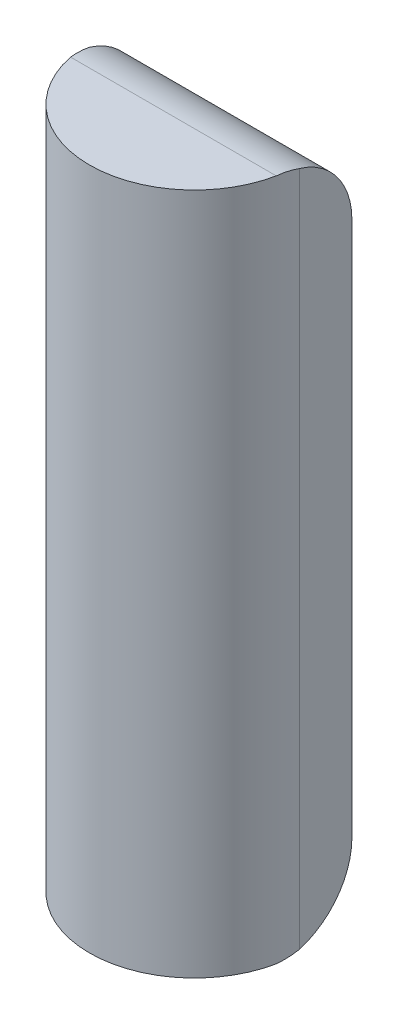
ISO-10303-21;
HEADER;
FILE_DESCRIPTION(('STEP AP214'),'2;1');
FILE_NAME('part.step','',(''),(''),'','','');
FILE_SCHEMA(('AUTOMOTIVE_DESIGN { 1 0 10303 214 1 1 1 1 }'));
ENDSEC;
DATA;
#1=APPLICATION_CONTEXT('core data for automotive mechanical design processes');
#2=APPLICATION_PROTOCOL_DEFINITION('international standard','automotive_design',2000,#1);
#3=PRODUCT_CONTEXT('',#1,'mechanical');
#4=PRODUCT('Part','Part','',(#3));
#5=PRODUCT_RELATED_PRODUCT_CATEGORY('part','',(#4));
#6=PRODUCT_DEFINITION_FORMATION('','',#4);
#7=PRODUCT_DEFINITION_CONTEXT('part definition',#1,'design');
#8=PRODUCT_DEFINITION('design','',#6,#7);
#9=PRODUCT_DEFINITION_SHAPE('','',#8);
#10=(LENGTH_UNIT() NAMED_UNIT(*) SI_UNIT(.MILLI.,.METRE.));
#11=(NAMED_UNIT(*) PLANE_ANGLE_UNIT() SI_UNIT($,.RADIAN.));
#12=(NAMED_UNIT(*) SI_UNIT($,.STERADIAN.) SOLID_ANGLE_UNIT());
#13=UNCERTAINTY_MEASURE_WITH_UNIT(LENGTH_MEASURE(1.E-05),#10,'distance_accuracy_value','');
#14=(GEOMETRIC_REPRESENTATION_CONTEXT(3) GLOBAL_UNCERTAINTY_ASSIGNED_CONTEXT((#13)) GLOBAL_UNIT_ASSIGNED_CONTEXT((#10,
#11,#12)) REPRESENTATION_CONTEXT('',''));
#15=CARTESIAN_POINT('',(0.,0.,0.));
#16=DIRECTION('',(0.,0.,1.));
#17=DIRECTION('',(1.,0.,0.));
#18=AXIS2_PLACEMENT_3D('',#15,#16,#17);
#19=CARTESIAN_POINT('',(-0.6,0.,-0.35));
#20=DIRECTION('',(0.,1.,0.));
#21=DIRECTION('',(0.,0.,1.));
#22=AXIS2_PLACEMENT_3D('',#19,#20,#21);
#23=CYLINDRICAL_SURFACE('',#22,0.1);
#24=CARTESIAN_POINT('',(-0.6,0.,-0.35));
#25=DIRECTION('',(0.,1.,0.));
#26=DIRECTION('',(0.,0.,1.));
#27=AXIS2_PLACEMENT_3D('',#24,#25,#26);
#28=CIRCLE('',#27,0.1);
#29=CARTESIAN_POINT('',(-0.697979589711327,0.,-0.33));
#30=VERTEX_POINT('',#29);
#31=CARTESIAN_POINT('',(-0.502020410288673,0.,-0.33));
#32=VERTEX_POINT('',#31);
#33=EDGE_CURVE('E11',#30,#32,#28,.T.);
#34=ORIENTED_EDGE('',*,*,#33,.T.);
#35=CARTESIAN_POINT('',(-0.5,0.00291796067500546,-0.349999999999997));
#36=CARTESIAN_POINT('',(-0.500084183762029,0.00267649394960232,-0.349190121189793));
#37=CARTESIAN_POINT('',(-0.500168367524058,0.00244970743001094,-0.348375866058584));
#38=CARTESIAN_POINT('',(-0.500336735048117,0.00202576163123395,-0.34673967912913));
#39=CARTESIAN_POINT('',(-0.500420918810146,0.00182860235204834,-0.345917747330885));
#40=CARTESIAN_POINT('',(-0.500589286334204,0.00146417786286509,-0.344267283042332));
#41=CARTESIAN_POINT('',(-0.500673470096233,0.00129691265286746,-0.343438750552023));
#42=CARTESIAN_POINT('',(-0.500841837620292,0.000992493455461815,-0.341776172212152));
#43=CARTESIAN_POINT('',(-0.500926021382321,0.000855339468053803,-0.340942126362589));
#44=CARTESIAN_POINT('',(-0.501094388906379,0.000611323369011913,-0.339269615138349));
#45=CARTESIAN_POINT('',(-0.501178572668408,0.000504461257378036,-0.338431149763672));
#46=CARTESIAN_POINT('',(-0.501346940192467,0.000321168311295584,-0.336750899341898));
#47=CARTESIAN_POINT('',(-0.501431123954496,0.000244737476847011,-0.3359091142948));
#48=CARTESIAN_POINT('',(-0.501599491478554,0.000122409650322978,-0.334223328579187));
#49=CARTESIAN_POINT('',(-0.501683675240583,7.65126582475191E-05,-0.333379327910672));
#50=CARTESIAN_POINT('',(-0.501852042764642,1.53042319068217E-05,-0.331690218311812));
#51=CARTESIAN_POINT('',(-0.501936226526671,-7.2023584184188E-09,-0.330845109381467));
#52=CARTESIAN_POINT('',(-0.5020204102887,0.,-0.33));
#53=B_SPLINE_CURVE_WITH_KNOTS('',3,(#35,#36,#37,#38,#39,#40,#41,#42,#43,#44,#45,#46,#47,#48,#49,
#50,#51,#52),.UNSPECIFIED.,.F.,.F.,(4,2,2,2,2,2,2,2,4),(0.,0.00254773712594299,
0.00509547425188588,0.00764321137782883,0.0101909485037718,0.0127386856297147,
0.0152864227556576,0.0178341598816006,0.0203818970075435),.UNSPECIFIED.);
#54=CARTESIAN_POINT('',(-0.5,0.0029179606750063,-0.35));
#55=VERTEX_POINT('',#54);
#56=EDGE_CURVE('E25',#55,#32,#53,.T.);
#57=ORIENTED_EDGE('',*,*,#56,.F.);
#58=DIRECTION('',(0.,1.,0.));
#59=VECTOR('',#58,1.);
#60=CARTESIAN_POINT('',(-0.5,0.,-0.35));
#61=LINE('',#60,#59);
#62=CARTESIAN_POINT('',(-0.5,0.647082039324994,-0.35));
#63=VERTEX_POINT('',#62);
#64=EDGE_CURVE('E156',#55,#63,#61,.T.);
#65=ORIENTED_EDGE('',*,*,#64,.T.);
#66=CARTESIAN_POINT('',(-0.502020410288673,0.65,-0.33));
#67=CARTESIAN_POINT('',(-0.501936226526645,0.650000007202358,-0.330845109381467));
#68=CARTESIAN_POINT('',(-0.501852042764617,0.649984695768093,-0.331690218311812));
#69=CARTESIAN_POINT('',(-0.501683675240561,0.649923487341753,-0.333379327910672));
#70=CARTESIAN_POINT('',(-0.501599491478533,0.649877590349677,-0.334223328579187));
#71=CARTESIAN_POINT('',(-0.501431123954477,0.649755262523153,-0.3359091142948));
#72=CARTESIAN_POINT('',(-0.501346940192449,0.649678831688704,-0.336750899341898));
#73=CARTESIAN_POINT('',(-0.501178572668392,0.649495538742622,-0.338431149763672));
#74=CARTESIAN_POINT('',(-0.501094388906365,0.649388676630988,-0.339269615138349));
#75=CARTESIAN_POINT('',(-0.500926021382308,0.649144660531946,-0.340942126362589));
#76=CARTESIAN_POINT('',(-0.50084183762028,0.649007506544538,-0.341776172212152));
#77=CARTESIAN_POINT('',(-0.500673470096224,0.648703087347133,-0.343438750552023));
#78=CARTESIAN_POINT('',(-0.500589286334196,0.648535822137135,-0.344267283042332));
#79=CARTESIAN_POINT('',(-0.50042091881014,0.648171397647952,-0.345917747330885));
#80=CARTESIAN_POINT('',(-0.500336735048112,0.647974238368766,-0.34673967912913));
#81=CARTESIAN_POINT('',(-0.500168367524056,0.647550292569989,-0.348375866058584));
#82=CARTESIAN_POINT('',(-0.500084183762028,0.647323506050398,-0.349190121189793));
#83=CARTESIAN_POINT('',(-0.5,0.647082039324995,-0.349999999999997));
#84=B_SPLINE_CURVE_WITH_KNOTS('',3,(#66,#67,#68,#69,#70,#71,#72,#73,#74,#75,#76,#77,#78,#79,#80,
#81,#82,#83),.UNSPECIFIED.,.F.,.F.,(4,2,2,2,2,2,2,2,4),(0.,0.00254773712594261,
0.00509547425188519,0.00764321137782786,0.0101909485037705,0.0127386856297131,
0.0152864227556557,0.0178341598815984,0.020381897007541),.UNSPECIFIED.);
#85=CARTESIAN_POINT('',(-0.502020410288673,0.65,-0.33));
#86=VERTEX_POINT('',#85);
#87=EDGE_CURVE('E198',#86,#63,#84,.T.);
#88=ORIENTED_EDGE('',*,*,#87,.F.);
#89=CARTESIAN_POINT('',(-0.6,0.65,-0.35));
#90=DIRECTION('',(0.,1.,0.));
#91=DIRECTION('',(0.,0.,1.));
#92=AXIS2_PLACEMENT_3D('',#89,#90,#91);
#93=CIRCLE('',#92,0.1);
#94=CARTESIAN_POINT('',(-0.697979589711327,0.65,-0.33));
#95=VERTEX_POINT('',#94);
#96=EDGE_CURVE('E208',#95,#86,#93,.T.);
#97=ORIENTED_EDGE('',*,*,#96,.F.);
#98=CARTESIAN_POINT('',(-0.7,0.647082039324995,-0.349999999999997));
#99=CARTESIAN_POINT('',(-0.699915816237972,0.647323506050398,-0.349190121189793));
#100=CARTESIAN_POINT('',(-0.699831632475944,0.647550292569989,-0.348375866058584));
#101=CARTESIAN_POINT('',(-0.699663264951888,0.647974238368766,-0.34673967912913));
#102=CARTESIAN_POINT('',(-0.69957908118986,0.648171397647952,-0.345917747330885));
#103=CARTESIAN_POINT('',(-0.699410713665804,0.648535822137135,-0.344267283042332));
#104=CARTESIAN_POINT('',(-0.699326529903776,0.648703087347133,-0.343438750552023));
#105=CARTESIAN_POINT('',(-0.69915816237972,0.649007506544538,-0.341776172212152));
#106=CARTESIAN_POINT('',(-0.699073978617692,0.649144660531946,-0.340942126362589));
#107=CARTESIAN_POINT('',(-0.698905611093635,0.649388676630988,-0.339269615138349));
#108=CARTESIAN_POINT('',(-0.698821427331607,0.649495538742622,-0.338431149763672));
#109=CARTESIAN_POINT('',(-0.698653059807551,0.649678831688704,-0.336750899341898));
#110=CARTESIAN_POINT('',(-0.698568876045523,0.649755262523153,-0.3359091142948));
#111=CARTESIAN_POINT('',(-0.698400508521467,0.649877590349677,-0.334223328579187));
#112=CARTESIAN_POINT('',(-0.698316324759439,0.649923487341753,-0.333379327910672));
#113=CARTESIAN_POINT('',(-0.698147957235383,0.649984695768093,-0.331690218311812));
#114=CARTESIAN_POINT('',(-0.698063773473355,0.650000007202358,-0.330845109381467));
#115=CARTESIAN_POINT('',(-0.697979589711327,0.65,-0.33));
#116=B_SPLINE_CURVE_WITH_KNOTS('',3,(#98,#99,#100,#101,#102,#103,#104,#105,#106,#107,#108,#109,
#110,#111,#112,#113,#114,#115),.UNSPECIFIED.,.F.,.F.,(4,2,2,2,2,2,2,2,4),(0.,
0.00254773712594261,0.00509547425188528,0.00764321137782783,0.0101909485037704,
0.0127386856297131,0.0152864227556557,0.0178341598815983,0.020381897007541),.UNSPECIFIED.);
#117=CARTESIAN_POINT('',(-0.7,0.647082039324994,-0.35));
#118=VERTEX_POINT('',#117);
#119=EDGE_CURVE('E210',#118,#95,#116,.T.);
#120=ORIENTED_EDGE('',*,*,#119,.F.);
#121=DIRECTION('',(0.,1.,0.));
#122=VECTOR('',#121,1.);
#123=CARTESIAN_POINT('',(-0.7,0.,-0.35));
#124=LINE('',#123,#122);
#125=CARTESIAN_POINT('',(-0.7,0.00291796067500542,-0.349999999999999));
#126=VERTEX_POINT('',#125);
#127=EDGE_CURVE('E214',#126,#118,#124,.T.);
#128=ORIENTED_EDGE('',*,*,#127,.F.);
#129=CARTESIAN_POINT('',(-0.6979795897113,0.,-0.33));
#130=CARTESIAN_POINT('',(-0.698063773473329,-7.20235840593909E-09,-0.330845109381467));
#131=CARTESIAN_POINT('',(-0.698147957235358,1.53042319068296E-05,-0.331690218311812));
#132=CARTESIAN_POINT('',(-0.698316324759417,7.651265824751E-05,-0.333379327910672));
#133=CARTESIAN_POINT('',(-0.698400508521446,0.000122409650322955,-0.334223328579187));
#134=CARTESIAN_POINT('',(-0.698568876045504,0.00024473747684698,-0.335909114294799));
#135=CARTESIAN_POINT('',(-0.698653059807533,0.00032116831129556,-0.336750899341897));
#136=CARTESIAN_POINT('',(-0.698821427331592,0.000504461257378002,-0.338431149763672));
#137=CARTESIAN_POINT('',(-0.698905611093621,0.000611323369011863,-0.339269615138349));
#138=CARTESIAN_POINT('',(-0.699073978617679,0.000855339468053722,-0.340942126362589));
#139=CARTESIAN_POINT('',(-0.699158162379708,0.000992493455461721,-0.341776172212151));
#140=CARTESIAN_POINT('',(-0.699326529903767,0.00129691265286734,-0.343438750552023));
#141=CARTESIAN_POINT('',(-0.699410713665796,0.00146417786286495,-0.344267283042331));
#142=CARTESIAN_POINT('',(-0.699579081189854,0.00182860235204816,-0.345917747330884));
#143=CARTESIAN_POINT('',(-0.699663264951883,0.00202576163123375,-0.346739679129129));
#144=CARTESIAN_POINT('',(-0.699831632475942,0.0024497074300107,-0.348375866058583));
#145=CARTESIAN_POINT('',(-0.699915816237971,0.00267649394960205,-0.349190121189792));
#146=CARTESIAN_POINT('',(-0.7,0.00291796067500518,-0.349999999999996));
#147=B_SPLINE_CURVE_WITH_KNOTS('',3,(#129,#130,#131,#132,#133,#134,#135,#136,#137,#138,#139,
#140,#141,#142,#143,#144,#145,#146),.UNSPECIFIED.,.F.,.F.,(4,2,2,2,2,2,2,2,4),(0.,
0.00254773712594282,0.00509547425188567,0.00764321137782849,0.0101909485037712,
0.012738685629714,0.0152864227556568,0.0178341598815996,0.0203818970075425),.UNSPECIFIED.);
#148=EDGE_CURVE('E85',#30,#126,#147,.T.);
#149=ORIENTED_EDGE('',*,*,#148,.F.);
#150=EDGE_LOOP('',(#34,#57,#65,#88,#97,#120,#128,#149));
#151=FACE_BOUND('',#150,.T.);
#152=ADVANCED_FACE('F17',(#151),#23,.T.);
#153=CARTESIAN_POINT('',(-0.5,0.,-0.35));
#154=DIRECTION('',(1.,0.,0.));
#155=DIRECTION('',(0.,0.,-1.));
#156=AXIS2_PLACEMENT_3D('',#153,#154,#155);
#157=PLANE('',#156);
#158=CARTESIAN_POINT('',(-0.499999999999999,0.58,-0.33));
#159=DIRECTION('',(-1.,0.,0.));
#160=DIRECTION('',(0.,0.,-1.));
#161=AXIS2_PLACEMENT_3D('',#158,#159,#160);
#162=CIRCLE('',#161,0.07);
#163=CARTESIAN_POINT('',(-0.5,0.58,-0.4));
#164=VERTEX_POINT('',#163);
#165=EDGE_CURVE('E114',#63,#164,#162,.T.);
#166=ORIENTED_EDGE('',*,*,#165,.F.);
#167=ORIENTED_EDGE('',*,*,#64,.F.);
#168=CARTESIAN_POINT('',(-0.5,0.07,-0.33));
#169=DIRECTION('',(-1.,0.,0.));
#170=DIRECTION('',(0.,0.,-1.));
#171=AXIS2_PLACEMENT_3D('',#168,#169,#170);
#172=CIRCLE('',#171,0.07);
#173=CARTESIAN_POINT('',(-0.5,0.07,-0.4));
#174=VERTEX_POINT('',#173);
#175=EDGE_CURVE('E110',#174,#55,#172,.T.);
#176=ORIENTED_EDGE('',*,*,#175,.F.);
#177=DIRECTION('',(0.,1.,0.));
#178=VECTOR('',#177,1.);
#179=CARTESIAN_POINT('',(-0.5,0.65,-0.4));
#180=LINE('',#179,#178);
#181=EDGE_CURVE('E92',#174,#164,#180,.T.);
#182=ORIENTED_EDGE('',*,*,#181,.T.);
#183=EDGE_LOOP('',(#166,#167,#176,#182));
#184=FACE_BOUND('',#183,.T.);
#185=ADVANCED_FACE('F162',(#184),#157,.T.);
#186=CARTESIAN_POINT('',(-0.7,0.,-0.4));
#187=DIRECTION('',(-1.,0.,0.));
#188=DIRECTION('',(0.,0.,1.));
#189=AXIS2_PLACEMENT_3D('',#186,#187,#188);
#190=PLANE('',#189);
#191=CARTESIAN_POINT('',(-0.7,0.58,-0.33));
#192=DIRECTION('',(1.,0.,0.));
#193=DIRECTION('',(0.,0.,1.));
#194=AXIS2_PLACEMENT_3D('',#191,#192,#193);
#195=CIRCLE('',#194,0.07);
#196=CARTESIAN_POINT('',(-0.7,0.58,-0.4));
#197=VERTEX_POINT('',#196);
#198=EDGE_CURVE('E72',#197,#118,#195,.T.);
#199=ORIENTED_EDGE('',*,*,#198,.F.);
#200=DIRECTION('',(0.,-1.,0.));
#201=VECTOR('',#200,1.);
#202=CARTESIAN_POINT('',(-0.7,0.65,-0.4));
#203=LINE('',#202,#201);
#204=CARTESIAN_POINT('',(-0.7,0.07,-0.4));
#205=VERTEX_POINT('',#204);
#206=EDGE_CURVE('E66',#197,#205,#203,.T.);
#207=ORIENTED_EDGE('',*,*,#206,.T.);
#208=CARTESIAN_POINT('',(-0.7,0.07,-0.33));
#209=DIRECTION('',(1.,0.,0.));
#210=DIRECTION('',(0.,0.,1.));
#211=AXIS2_PLACEMENT_3D('',#208,#209,#210);
#212=CIRCLE('',#211,0.07);
#213=EDGE_CURVE('E70',#126,#205,#212,.T.);
#214=ORIENTED_EDGE('',*,*,#213,.F.);
#215=ORIENTED_EDGE('',*,*,#127,.T.);
#216=EDGE_LOOP('',(#199,#207,#214,#215));
#217=FACE_BOUND('',#216,.T.);
#218=ADVANCED_FACE('F68',(#217),#190,.T.);
#219=CARTESIAN_POINT('',(0.,0.58,-0.33));
#220=DIRECTION('',(1.,0.,0.));
#221=DIRECTION('',(0.,0.,-1.));
#222=AXIS2_PLACEMENT_3D('',#219,#220,#221);
#223=CYLINDRICAL_SURFACE('',#222,0.07);
#224=DIRECTION('',(1.,0.,0.));
#225=VECTOR('',#224,1.);
#226=CARTESIAN_POINT('',(0.8,0.58,-0.4));
#227=LINE('',#226,#225);
#228=EDGE_CURVE('E87',#197,#164,#227,.T.);
#229=ORIENTED_EDGE('',*,*,#228,.F.);
#230=ORIENTED_EDGE('',*,*,#198,.T.);
#231=ORIENTED_EDGE('',*,*,#119,.T.);
#232=DIRECTION('',(-1.,0.,0.));
#233=VECTOR('',#232,1.);
#234=CARTESIAN_POINT('',(-0.8,0.65,-0.33));
#235=LINE('',#234,#233);
#236=EDGE_CURVE('E93',#86,#95,#235,.T.);
#237=ORIENTED_EDGE('',*,*,#236,.F.);
#238=ORIENTED_EDGE('',*,*,#87,.T.);
#239=ORIENTED_EDGE('',*,*,#165,.T.);
#240=EDGE_LOOP('',(#229,#230,#231,#237,#238,#239));
#241=FACE_BOUND('',#240,.T.);
#242=ADVANCED_FACE('F170',(#241),#223,.T.);
#243=CARTESIAN_POINT('',(0.,0.65,0.));
#244=DIRECTION('',(0.,1.,0.));
#245=DIRECTION('',(0.,0.,1.));
#246=AXIS2_PLACEMENT_3D('',#243,#244,#245);
#247=PLANE('',#246);
#248=ORIENTED_EDGE('',*,*,#236,.T.);
#249=ORIENTED_EDGE('',*,*,#96,.T.);
#250=EDGE_LOOP('',(#248,#249));
#251=FACE_BOUND('',#250,.T.);
#252=ADVANCED_FACE('F176',(#251),#247,.T.);
#253=CARTESIAN_POINT('',(0.8,0.65,-0.4));
#254=DIRECTION('',(0.,0.,1.));
#255=DIRECTION('',(1.,0.,0.));
#256=AXIS2_PLACEMENT_3D('',#253,#254,#255);
#257=PLANE('',#256);
#258=ORIENTED_EDGE('',*,*,#206,.F.);
#259=ORIENTED_EDGE('',*,*,#228,.T.);
#260=ORIENTED_EDGE('',*,*,#181,.F.);
#261=DIRECTION('',(-1.,0.,0.));
#262=VECTOR('',#261,1.);
#263=CARTESIAN_POINT('',(0.8,0.07,-0.4));
#264=LINE('',#263,#262);
#265=EDGE_CURVE('E83',#174,#205,#264,.T.);
#266=ORIENTED_EDGE('',*,*,#265,.T.);
#267=EDGE_LOOP('',(#258,#259,#260,#266));
#268=FACE_BOUND('',#267,.T.);
#269=ADVANCED_FACE('F90',(#268),#257,.F.);
#270=CARTESIAN_POINT('',(0.8,0.07,-0.33));
#271=DIRECTION('',(-1.,0.,0.));
#272=DIRECTION('',(0.,0.,1.));
#273=AXIS2_PLACEMENT_3D('',#270,#271,#272);
#274=CYLINDRICAL_SURFACE('',#273,0.07);
#275=ORIENTED_EDGE('',*,*,#148,.T.);
#276=ORIENTED_EDGE('',*,*,#213,.T.);
#277=ORIENTED_EDGE('',*,*,#265,.F.);
#278=ORIENTED_EDGE('',*,*,#175,.T.);
#279=ORIENTED_EDGE('',*,*,#56,.T.);
#280=DIRECTION('',(1.,0.,0.));
#281=VECTOR('',#280,1.);
#282=CARTESIAN_POINT('',(0.,0.,-0.33));
#283=LINE('',#282,#281);
#284=EDGE_CURVE('E94',#30,#32,#283,.T.);
#285=ORIENTED_EDGE('',*,*,#284,.F.);
#286=EDGE_LOOP('',(#275,#276,#277,#278,#279,#285));
#287=FACE_BOUND('',#286,.T.);
#288=ADVANCED_FACE('F81',(#287),#274,.T.);
#289=CARTESIAN_POINT('',(0.,0.,0.));
#290=DIRECTION('',(0.,1.,0.));
#291=DIRECTION('',(0.,0.,1.));
#292=AXIS2_PLACEMENT_3D('',#289,#290,#291);
#293=PLANE('',#292);
#294=ORIENTED_EDGE('',*,*,#33,.F.);
#295=ORIENTED_EDGE('',*,*,#284,.T.);
#296=EDGE_LOOP('',(#294,#295));
#297=FACE_BOUND('',#296,.T.);
#298=ADVANCED_FACE('F140',(#297),#293,.F.);
#299=CLOSED_SHELL('',(#152,#185,#218,#242,#252,#269,#288,#298));
#300=MANIFOLD_SOLID_BREP('B1',#299);
#301=ADVANCED_BREP_SHAPE_REPRESENTATION('',(#18,#300),#14);
#302=SHAPE_DEFINITION_REPRESENTATION(#9,#301);
ENDSEC;
END-ISO-10303-21;
